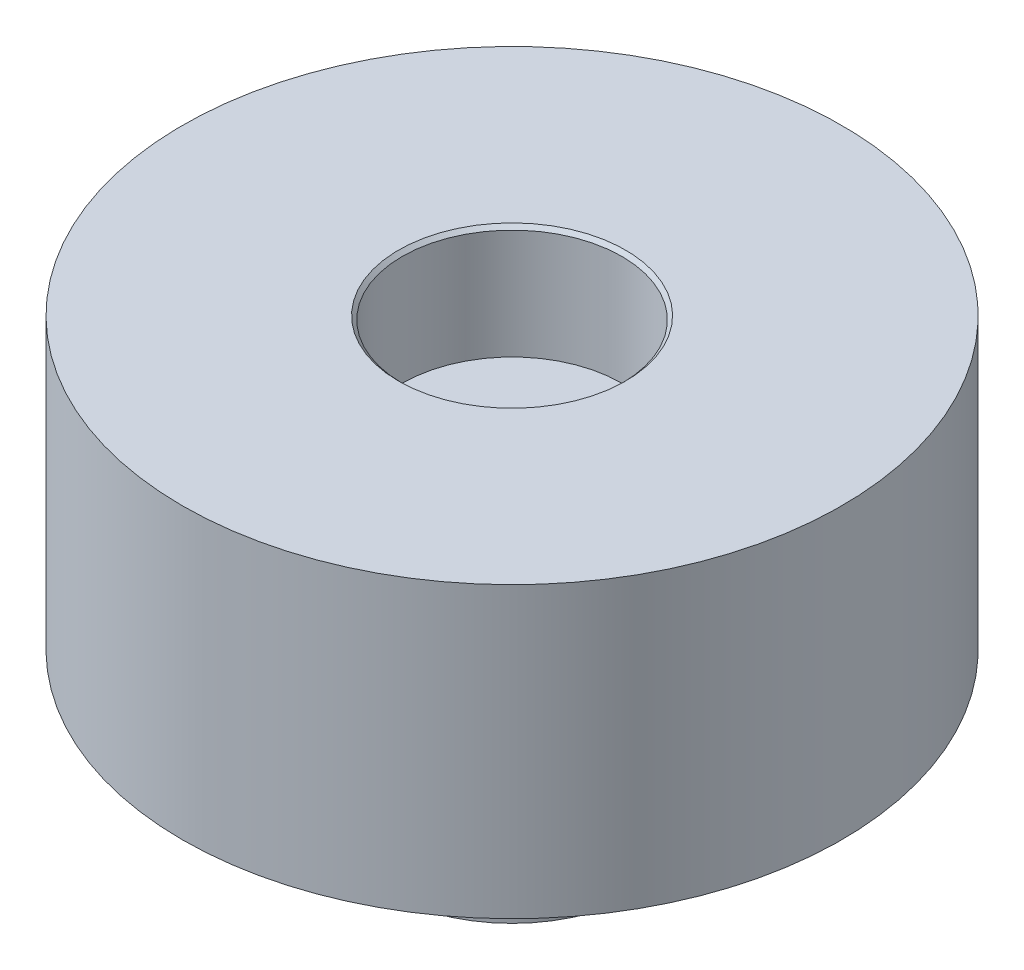
ISO-10303-21;
HEADER;
FILE_DESCRIPTION(('STEP AP214'),'2;1');
FILE_NAME('part.step','',(''),(''),'','','');
FILE_SCHEMA(('AUTOMOTIVE_DESIGN { 1 0 10303 214 1 1 1 1 }'));
ENDSEC;
DATA;
#1=APPLICATION_CONTEXT('core data for automotive mechanical design processes');
#2=APPLICATION_PROTOCOL_DEFINITION('international standard','automotive_design',2000,#1);
#3=PRODUCT_CONTEXT('',#1,'mechanical');
#4=PRODUCT('Part','Part','',(#3));
#5=PRODUCT_RELATED_PRODUCT_CATEGORY('part','',(#4));
#6=PRODUCT_DEFINITION_FORMATION('','',#4);
#7=PRODUCT_DEFINITION_CONTEXT('part definition',#1,'design');
#8=PRODUCT_DEFINITION('design','',#6,#7);
#9=PRODUCT_DEFINITION_SHAPE('','',#8);
#10=(LENGTH_UNIT() NAMED_UNIT(*) SI_UNIT(.MILLI.,.METRE.));
#11=(NAMED_UNIT(*) PLANE_ANGLE_UNIT() SI_UNIT($,.RADIAN.));
#12=(NAMED_UNIT(*) SI_UNIT($,.STERADIAN.) SOLID_ANGLE_UNIT());
#13=UNCERTAINTY_MEASURE_WITH_UNIT(LENGTH_MEASURE(1.E-05),#10,'distance_accuracy_value','');
#14=(GEOMETRIC_REPRESENTATION_CONTEXT(3) GLOBAL_UNCERTAINTY_ASSIGNED_CONTEXT((#13)) GLOBAL_UNIT_ASSIGNED_CONTEXT((#10,
#11,#12)) REPRESENTATION_CONTEXT('',''));
#15=CARTESIAN_POINT('',(0.,0.,0.));
#16=DIRECTION('',(0.,0.,1.));
#17=DIRECTION('',(1.,0.,0.));
#18=AXIS2_PLACEMENT_3D('',#15,#16,#17);
#19=CARTESIAN_POINT('',(0.,7.9,0.));
#20=DIRECTION('',(0.,-1.,0.));
#21=DIRECTION('',(0.,0.,-1.));
#22=AXIS2_PLACEMENT_3D('',#19,#20,#21);
#23=CYLINDRICAL_SURFACE('',#22,9.);
#24=CARTESIAN_POINT('',(0.,7.9,0.));
#25=DIRECTION('',(0.,1.,0.));
#26=DIRECTION('',(0.,0.,1.));
#27=AXIS2_PLACEMENT_3D('',#24,#25,#26);
#28=CIRCLE('',#27,9.);
#29=CARTESIAN_POINT('',(0.,7.9,9.));
#30=VERTEX_POINT('',#29);
#31=EDGE_CURVE('E84',#30,#30,#28,.T.);
#32=ORIENTED_EDGE('',*,*,#31,.F.);
#33=EDGE_LOOP('',(#32));
#34=FACE_BOUND('',#33,.T.);
#35=CARTESIAN_POINT('',(0.,0.,0.));
#36=DIRECTION('',(0.,1.,0.));
#37=DIRECTION('',(0.,0.,1.));
#38=AXIS2_PLACEMENT_3D('',#35,#36,#37);
#39=CIRCLE('',#38,9.);
#40=CARTESIAN_POINT('',(0.,0.,9.));
#41=VERTEX_POINT('',#40);
#42=EDGE_CURVE('E88',#41,#41,#39,.T.);
#43=ORIENTED_EDGE('',*,*,#42,.T.);
#44=EDGE_LOOP('',(#43));
#45=FACE_BOUND('',#44,.T.);
#46=ADVANCED_FACE('F45',(#34,#45),#23,.T.);
#47=CARTESIAN_POINT('',(0.,7.9,0.));
#48=DIRECTION('',(0.,1.,0.));
#49=DIRECTION('',(0.,0.,1.));
#50=AXIS2_PLACEMENT_3D('',#47,#48,#49);
#51=PLANE('',#50);
#52=CARTESIAN_POINT('',(0.,7.9,0.));
#53=DIRECTION('',(0.,1.,0.));
#54=DIRECTION('',(0.,0.,1.));
#55=AXIS2_PLACEMENT_3D('',#52,#53,#54);
#56=CIRCLE('',#55,3.10000000000001);
#57=CARTESIAN_POINT('',(0.,7.9,3.10000000000001));
#58=VERTEX_POINT('',#57);
#59=EDGE_CURVE('E11',#58,#58,#56,.F.);
#60=ORIENTED_EDGE('',*,*,#59,.T.);
#61=EDGE_LOOP('',(#60));
#62=FACE_BOUND('',#61,.T.);
#63=ORIENTED_EDGE('',*,*,#31,.T.);
#64=EDGE_LOOP('',(#63));
#65=FACE_BOUND('',#64,.T.);
#66=ADVANCED_FACE('F111',(#62,#65),#51,.T.);
#67=CARTESIAN_POINT('',(0.,0.,0.));
#68=DIRECTION('',(0.,1.,0.));
#69=DIRECTION('',(0.,0.,1.));
#70=AXIS2_PLACEMENT_3D('',#67,#68,#69);
#71=PLANE('',#70);
#72=CARTESIAN_POINT('',(0.,0.,0.));
#73=DIRECTION('',(0.,-1.,0.));
#74=DIRECTION('',(0.,0.,-1.));
#75=AXIS2_PLACEMENT_3D('',#72,#73,#74);
#76=CIRCLE('',#75,3.5);
#77=CARTESIAN_POINT('',(0.,0.,-3.5));
#78=VERTEX_POINT('',#77);
#79=EDGE_CURVE('E80',#78,#78,#76,.T.);
#80=ORIENTED_EDGE('',*,*,#79,.F.);
#81=EDGE_LOOP('',(#80));
#82=FACE_BOUND('',#81,.T.);
#83=ORIENTED_EDGE('',*,*,#42,.F.);
#84=EDGE_LOOP('',(#83));
#85=FACE_BOUND('',#84,.T.);
#86=ADVANCED_FACE('F116',(#82,#85),#71,.F.);
#87=CARTESIAN_POINT('',(0.,4.8,0.));
#88=DIRECTION('',(0.,1.,0.));
#89=DIRECTION('',(0.,0.,1.));
#90=AXIS2_PLACEMENT_3D('',#87,#88,#89);
#91=CYLINDRICAL_SURFACE('',#90,3.);
#92=CARTESIAN_POINT('',(0.,7.79999999999999,0.));
#93=DIRECTION('',(0.,1.,0.));
#94=DIRECTION('',(0.,0.,1.));
#95=AXIS2_PLACEMENT_3D('',#92,#93,#94);
#96=CIRCLE('',#95,3.);
#97=CARTESIAN_POINT('',(0.,7.79999999999999,3.));
#98=VERTEX_POINT('',#97);
#99=EDGE_CURVE('E53',#98,#98,#96,.T.);
#100=ORIENTED_EDGE('',*,*,#99,.T.);
#101=EDGE_LOOP('',(#100));
#102=FACE_BOUND('',#101,.T.);
#103=CARTESIAN_POINT('',(0.,4.8,0.));
#104=DIRECTION('',(0.,1.,0.));
#105=DIRECTION('',(0.,0.,1.));
#106=AXIS2_PLACEMENT_3D('',#103,#104,#105);
#107=CIRCLE('',#106,3.);
#108=CARTESIAN_POINT('',(0.,4.8,3.));
#109=VERTEX_POINT('',#108);
#110=EDGE_CURVE('E73',#109,#109,#107,.T.);
#111=ORIENTED_EDGE('',*,*,#110,.F.);
#112=EDGE_LOOP('',(#111));
#113=FACE_BOUND('',#112,.T.);
#114=ADVANCED_FACE('F98',(#102,#113),#91,.F.);
#115=CARTESIAN_POINT('',(0.,4.8,0.));
#116=DIRECTION('',(0.,1.,0.));
#117=DIRECTION('',(0.,0.,1.));
#118=AXIS2_PLACEMENT_3D('',#115,#116,#117);
#119=PLANE('',#118);
#120=ORIENTED_EDGE('',*,*,#110,.T.);
#121=EDGE_LOOP('',(#120));
#122=FACE_BOUND('',#121,.T.);
#123=ADVANCED_FACE('F127',(#122),#119,.T.);
#124=CARTESIAN_POINT('',(0.,-4.,0.));
#125=DIRECTION('',(0.,1.,0.));
#126=DIRECTION('',(0.,0.,1.));
#127=AXIS2_PLACEMENT_3D('',#124,#125,#126);
#128=CYLINDRICAL_SURFACE('',#127,3.5);
#129=CARTESIAN_POINT('',(0.,-4.,0.));
#130=DIRECTION('',(0.,-1.,0.));
#131=DIRECTION('',(0.,0.,-1.));
#132=AXIS2_PLACEMENT_3D('',#129,#130,#131);
#133=CIRCLE('',#132,3.5);
#134=CARTESIAN_POINT('',(0.,-4.,-3.5));
#135=VERTEX_POINT('',#134);
#136=EDGE_CURVE('E67',#135,#135,#133,.T.);
#137=ORIENTED_EDGE('',*,*,#136,.F.);
#138=EDGE_LOOP('',(#137));
#139=FACE_BOUND('',#138,.T.);
#140=ORIENTED_EDGE('',*,*,#79,.T.);
#141=EDGE_LOOP('',(#140));
#142=FACE_BOUND('',#141,.T.);
#143=ADVANCED_FACE('F130',(#139,#142),#128,.T.);
#144=CARTESIAN_POINT('',(0.,-4.,0.));
#145=DIRECTION('',(0.,-1.,0.));
#146=DIRECTION('',(0.,0.,-1.));
#147=AXIS2_PLACEMENT_3D('',#144,#145,#146);
#148=PLANE('',#147);
#149=CARTESIAN_POINT('',(0.,-4.,0.));
#150=DIRECTION('',(0.,-1.,0.));
#151=DIRECTION('',(0.,0.,-1.));
#152=AXIS2_PLACEMENT_3D('',#149,#150,#151);
#153=CIRCLE('',#152,1.5975);
#154=CARTESIAN_POINT('',(0.,-4.,-1.5975));
#155=VERTEX_POINT('',#154);
#156=EDGE_CURVE('E76',#155,#155,#153,.T.);
#157=ORIENTED_EDGE('',*,*,#156,.F.);
#158=EDGE_LOOP('',(#157));
#159=FACE_BOUND('',#158,.T.);
#160=ORIENTED_EDGE('',*,*,#136,.T.);
#161=EDGE_LOOP('',(#160));
#162=FACE_BOUND('',#161,.T.);
#163=ADVANCED_FACE('F60',(#159,#162),#148,.T.);
#164=CARTESIAN_POINT('',(0.,2.85,0.));
#165=DIRECTION('',(0.,-1.,0.));
#166=DIRECTION('',(0.,0.,-1.));
#167=AXIS2_PLACEMENT_3D('',#164,#165,#166);
#168=CONICAL_SURFACE('',#167,1.275,1.02974425867665);
#169=CARTESIAN_POINT('',(0.,3.61609728926014,0.));
#170=VERTEX_POINT('',#169);
#171=VERTEX_LOOP('',#170);
#172=FACE_BOUND('',#171,.T.);
#173=CARTESIAN_POINT('',(0.,2.85,0.));
#174=DIRECTION('',(0.,-1.,0.));
#175=DIRECTION('',(0.,0.,-1.));
#176=AXIS2_PLACEMENT_3D('',#173,#174,#175);
#177=CIRCLE('',#176,1.275);
#178=CARTESIAN_POINT('',(0.,2.85,-1.275));
#179=VERTEX_POINT('',#178);
#180=EDGE_CURVE('E64',#179,#179,#177,.T.);
#181=ORIENTED_EDGE('',*,*,#180,.T.);
#182=EDGE_LOOP('',(#181));
#183=FACE_BOUND('',#182,.T.);
#184=ADVANCED_FACE('F56',(#172,#183),#168,.F.);
#185=CARTESIAN_POINT('',(0.,-4.,0.));
#186=DIRECTION('',(0.,-1.,0.));
#187=DIRECTION('',(0.,0.,-1.));
#188=AXIS2_PLACEMENT_3D('',#185,#186,#187);
#189=CYLINDRICAL_SURFACE('',#188,1.275);
#190=ORIENTED_EDGE('',*,*,#180,.F.);
#191=EDGE_LOOP('',(#190));
#192=FACE_BOUND('',#191,.T.);
#193=CARTESIAN_POINT('',(0.,-3.6775,0.));
#194=DIRECTION('',(0.,-1.,0.));
#195=DIRECTION('',(0.,0.,-1.));
#196=AXIS2_PLACEMENT_3D('',#193,#194,#195);
#197=CIRCLE('',#196,1.275);
#198=CARTESIAN_POINT('',(0.,-3.6775,-1.275));
#199=VERTEX_POINT('',#198);
#200=EDGE_CURVE('E68',#199,#199,#197,.T.);
#201=ORIENTED_EDGE('',*,*,#200,.T.);
#202=EDGE_LOOP('',(#201));
#203=FACE_BOUND('',#202,.T.);
#204=ADVANCED_FACE('F59',(#192,#203),#189,.F.);
#205=CARTESIAN_POINT('',(0.,-4.,0.));
#206=DIRECTION('',(0.,-1.,0.));
#207=DIRECTION('',(0.,0.,-1.));
#208=AXIS2_PLACEMENT_3D('',#205,#206,#207);
#209=CONICAL_SURFACE('',#208,1.5975,0.785398163397448);
#210=ORIENTED_EDGE('',*,*,#200,.F.);
#211=EDGE_LOOP('',(#210));
#212=FACE_BOUND('',#211,.T.);
#213=ORIENTED_EDGE('',*,*,#156,.T.);
#214=EDGE_LOOP('',(#213));
#215=FACE_BOUND('',#214,.T.);
#216=ADVANCED_FACE('F102',(#212,#215),#209,.F.);
#217=CARTESIAN_POINT('',(0.,7.79999999999999,0.));
#218=DIRECTION('',(0.,1.,0.));
#219=DIRECTION('',(0.,0.,1.));
#220=AXIS2_PLACEMENT_3D('',#217,#218,#219);
#221=CONICAL_SURFACE('',#220,3.,0.785398163397448);
#222=ORIENTED_EDGE('',*,*,#59,.F.);
#223=EDGE_LOOP('',(#222));
#224=FACE_BOUND('',#223,.T.);
#225=ORIENTED_EDGE('',*,*,#99,.F.);
#226=EDGE_LOOP('',(#225));
#227=FACE_BOUND('',#226,.T.);
#228=ADVANCED_FACE('F47',(#224,#227),#221,.F.);
#229=CLOSED_SHELL('',(#46,#66,#86,#114,#123,#143,#163,#184,#204,#216,#228));
#230=MANIFOLD_SOLID_BREP('B2',#229);
#231=ADVANCED_BREP_SHAPE_REPRESENTATION('',(#18,#230),#14);
#232=SHAPE_DEFINITION_REPRESENTATION(#9,#231);
ENDSEC;
END-ISO-10303-21;
